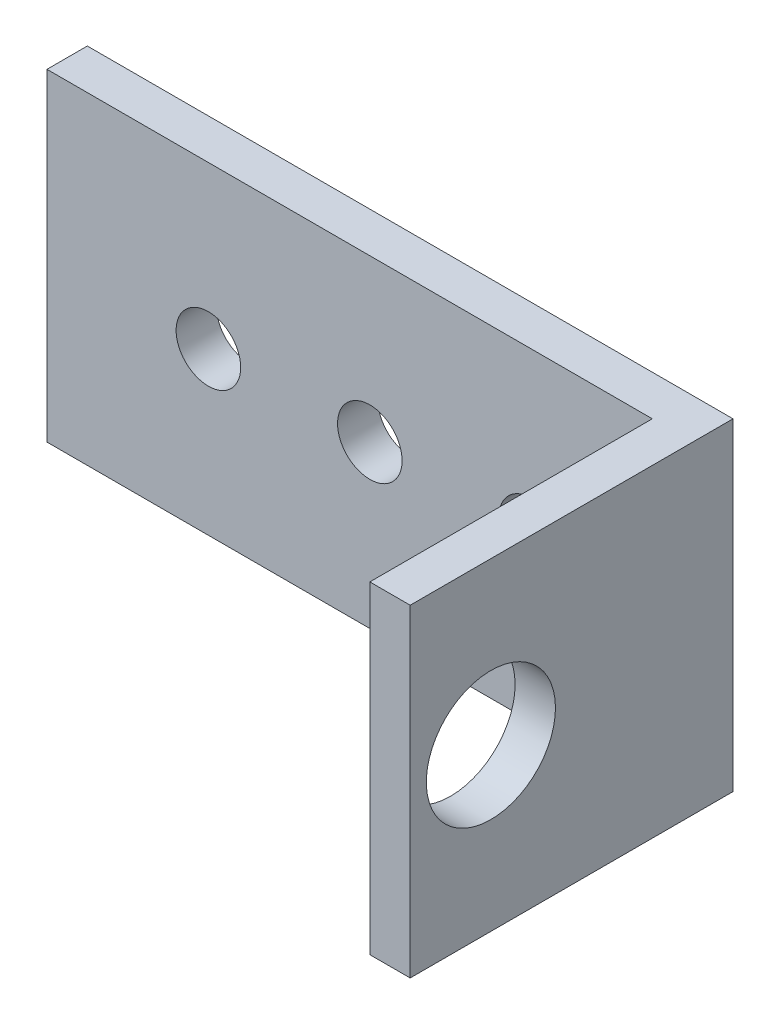
ISO-10303-21;
HEADER;
FILE_DESCRIPTION(('STEP AP214'),'2;1');
FILE_NAME('part.step','',(''),(''),'','','');
FILE_SCHEMA(('AUTOMOTIVE_DESIGN { 1 0 10303 214 1 1 1 1 }'));
ENDSEC;
DATA;
#1=APPLICATION_CONTEXT('core data for automotive mechanical design processes');
#2=APPLICATION_PROTOCOL_DEFINITION('international standard','automotive_design',2000,#1);
#3=PRODUCT_CONTEXT('',#1,'mechanical');
#4=PRODUCT('Part','Part','',(#3));
#5=PRODUCT_RELATED_PRODUCT_CATEGORY('part','',(#4));
#6=PRODUCT_DEFINITION_FORMATION('','',#4);
#7=PRODUCT_DEFINITION_CONTEXT('part definition',#1,'design');
#8=PRODUCT_DEFINITION('design','',#6,#7);
#9=PRODUCT_DEFINITION_SHAPE('','',#8);
#10=(LENGTH_UNIT() NAMED_UNIT(*) SI_UNIT(.MILLI.,.METRE.));
#11=(NAMED_UNIT(*) PLANE_ANGLE_UNIT() SI_UNIT($,.RADIAN.));
#12=(NAMED_UNIT(*) SI_UNIT($,.STERADIAN.) SOLID_ANGLE_UNIT());
#13=UNCERTAINTY_MEASURE_WITH_UNIT(LENGTH_MEASURE(1.E-05),#10,'distance_accuracy_value','');
#14=(GEOMETRIC_REPRESENTATION_CONTEXT(3) GLOBAL_UNCERTAINTY_ASSIGNED_CONTEXT((#13)) GLOBAL_UNIT_ASSIGNED_CONTEXT((#10,
#11,#12)) REPRESENTATION_CONTEXT('',''));
#15=CARTESIAN_POINT('',(0.,0.,0.));
#16=DIRECTION('',(0.,0.,1.));
#17=DIRECTION('',(1.,0.,0.));
#18=AXIS2_PLACEMENT_3D('',#15,#16,#17);
#19=CARTESIAN_POINT('',(22.225,25.4,0.));
#20=DIRECTION('',(-1.,0.,0.));
#21=DIRECTION('',(0.,0.,1.));
#22=AXIS2_PLACEMENT_3D('',#19,#20,#21);
#23=PLANE('',#22);
#24=CARTESIAN_POINT('',(22.225,12.7,6.35));
#25=DIRECTION('',(-1.,0.,0.));
#26=DIRECTION('',(0.,0.,1.));
#27=AXIS2_PLACEMENT_3D('',#24,#25,#26);
#28=CIRCLE('',#27,5.08);
#29=CARTESIAN_POINT('',(22.225,12.7,11.43));
#30=VERTEX_POINT('',#29);
#31=EDGE_CURVE('E122',#30,#30,#28,.F.);
#32=ORIENTED_EDGE('',*,*,#31,.T.);
#33=EDGE_LOOP('',(#32));
#34=FACE_BOUND('',#33,.T.);
#35=DIRECTION('',(0.,0.,-1.));
#36=VECTOR('',#35,1.);
#37=CARTESIAN_POINT('',(22.225,0.,0.));
#38=LINE('',#37,#36);
#39=CARTESIAN_POINT('',(22.225,0.,12.7));
#40=VERTEX_POINT('',#39);
#41=CARTESIAN_POINT('',(22.225,0.,-9.525));
#42=VERTEX_POINT('',#41);
#43=EDGE_CURVE('E118',#40,#42,#38,.T.);
#44=ORIENTED_EDGE('',*,*,#43,.F.);
#45=DIRECTION('',(0.,-1.,0.));
#46=VECTOR('',#45,1.);
#47=CARTESIAN_POINT('',(22.225,25.4,12.7));
#48=LINE('',#47,#46);
#49=CARTESIAN_POINT('',(22.225,25.4,12.7));
#50=VERTEX_POINT('',#49);
#51=EDGE_CURVE('E11',#50,#40,#48,.T.);
#52=ORIENTED_EDGE('',*,*,#51,.F.);
#53=DIRECTION('',(0.,0.,-1.));
#54=VECTOR('',#53,1.);
#55=CARTESIAN_POINT('',(22.225,25.4,0.));
#56=LINE('',#55,#54);
#57=CARTESIAN_POINT('',(22.225,25.4,-9.525));
#58=VERTEX_POINT('',#57);
#59=EDGE_CURVE('E132',#50,#58,#56,.T.);
#60=ORIENTED_EDGE('',*,*,#59,.T.);
#61=DIRECTION('',(0.,-1.,0.));
#62=VECTOR('',#61,1.);
#63=CARTESIAN_POINT('',(22.225,25.4,-9.525));
#64=LINE('',#63,#62);
#65=EDGE_CURVE('E81',#58,#42,#64,.T.);
#66=ORIENTED_EDGE('',*,*,#65,.T.);
#67=EDGE_LOOP('',(#44,#52,#60,#66));
#68=FACE_BOUND('',#67,.T.);
#69=ADVANCED_FACE('F37',(#34,#68),#23,.T.);
#70=CARTESIAN_POINT('',(0.,25.4,12.7));
#71=DIRECTION('',(0.,0.,-1.));
#72=DIRECTION('',(-1.,0.,0.));
#73=AXIS2_PLACEMENT_3D('',#70,#71,#72);
#74=PLANE('',#73);
#75=DIRECTION('',(1.,0.,0.));
#76=VECTOR('',#75,1.);
#77=CARTESIAN_POINT('',(0.,0.,12.7));
#78=LINE('',#77,#76);
#79=CARTESIAN_POINT('',(25.4,0.,12.7));
#80=VERTEX_POINT('',#79);
#81=EDGE_CURVE('E121',#40,#80,#78,.T.);
#82=ORIENTED_EDGE('',*,*,#81,.T.);
#83=DIRECTION('',(0.,-1.,0.));
#84=VECTOR('',#83,1.);
#85=CARTESIAN_POINT('',(25.4,25.4,12.7));
#86=LINE('',#85,#84);
#87=CARTESIAN_POINT('',(25.4,25.4,12.7));
#88=VERTEX_POINT('',#87);
#89=EDGE_CURVE('E45',#88,#80,#86,.T.);
#90=ORIENTED_EDGE('',*,*,#89,.F.);
#91=DIRECTION('',(1.,0.,0.));
#92=VECTOR('',#91,1.);
#93=CARTESIAN_POINT('',(0.,25.4,12.7));
#94=LINE('',#93,#92);
#95=EDGE_CURVE('E145',#50,#88,#94,.T.);
#96=ORIENTED_EDGE('',*,*,#95,.F.);
#97=ORIENTED_EDGE('',*,*,#51,.T.);
#98=EDGE_LOOP('',(#82,#90,#96,#97));
#99=FACE_BOUND('',#98,.T.);
#100=ADVANCED_FACE('F199',(#99),#74,.F.);
#101=CARTESIAN_POINT('',(25.4,25.4,0.));
#102=DIRECTION('',(-1.,0.,0.));
#103=DIRECTION('',(0.,0.,1.));
#104=AXIS2_PLACEMENT_3D('',#101,#102,#103);
#105=PLANE('',#104);
#106=CARTESIAN_POINT('',(25.4,12.7,6.35));
#107=DIRECTION('',(1.,0.,0.));
#108=DIRECTION('',(0.,0.,-1.));
#109=AXIS2_PLACEMENT_3D('',#106,#107,#108);
#110=CIRCLE('',#109,5.08);
#111=CARTESIAN_POINT('',(25.4,12.7,1.27));
#112=VERTEX_POINT('',#111);
#113=EDGE_CURVE('E151',#112,#112,#110,.T.);
#114=ORIENTED_EDGE('',*,*,#113,.F.);
#115=EDGE_LOOP('',(#114));
#116=FACE_BOUND('',#115,.T.);
#117=DIRECTION('',(0.,0.,-1.));
#118=VECTOR('',#117,1.);
#119=CARTESIAN_POINT('',(25.4,0.,0.));
#120=LINE('',#119,#118);
#121=CARTESIAN_POINT('',(25.4,0.,-12.7));
#122=VERTEX_POINT('',#121);
#123=EDGE_CURVE('E124',#80,#122,#120,.T.);
#124=ORIENTED_EDGE('',*,*,#123,.T.);
#125=DIRECTION('',(0.,-1.,0.));
#126=VECTOR('',#125,1.);
#127=CARTESIAN_POINT('',(25.4,25.4,-12.7));
#128=LINE('',#127,#126);
#129=CARTESIAN_POINT('',(25.4,25.4,-12.7));
#130=VERTEX_POINT('',#129);
#131=EDGE_CURVE('E105',#130,#122,#128,.T.);
#132=ORIENTED_EDGE('',*,*,#131,.F.);
#133=DIRECTION('',(0.,0.,-1.));
#134=VECTOR('',#133,1.);
#135=CARTESIAN_POINT('',(25.4,25.4,0.));
#136=LINE('',#135,#134);
#137=EDGE_CURVE('E110',#88,#130,#136,.T.);
#138=ORIENTED_EDGE('',*,*,#137,.F.);
#139=ORIENTED_EDGE('',*,*,#89,.T.);
#140=EDGE_LOOP('',(#124,#132,#138,#139));
#141=FACE_BOUND('',#140,.T.);
#142=ADVANCED_FACE('F139',(#116,#141),#105,.F.);
#143=CARTESIAN_POINT('',(0.,25.4,-12.7));
#144=DIRECTION('',(0.,0.,-1.));
#145=DIRECTION('',(-1.,0.,0.));
#146=AXIS2_PLACEMENT_3D('',#143,#144,#145);
#147=PLANE('',#146);
#148=CARTESIAN_POINT('',(-12.7,12.7,-12.7));
#149=DIRECTION('',(0.,0.,-1.));
#150=DIRECTION('',(-1.,0.,0.));
#151=AXIS2_PLACEMENT_3D('',#148,#149,#150);
#152=CIRCLE('',#151,2.54);
#153=CARTESIAN_POINT('',(-15.24,12.7,-12.7));
#154=VERTEX_POINT('',#153);
#155=EDGE_CURVE('E154',#154,#154,#152,.F.);
#156=ORIENTED_EDGE('',*,*,#155,.T.);
#157=EDGE_LOOP('',(#156));
#158=FACE_BOUND('',#157,.T.);
#159=CARTESIAN_POINT('',(0.,12.7,-12.7));
#160=DIRECTION('',(0.,0.,-1.));
#161=DIRECTION('',(-1.,0.,0.));
#162=AXIS2_PLACEMENT_3D('',#159,#160,#161);
#163=CIRCLE('',#162,2.54);
#164=CARTESIAN_POINT('',(-2.53999999999999,12.7,-12.7));
#165=VERTEX_POINT('',#164);
#166=EDGE_CURVE('E162',#165,#165,#163,.F.);
#167=ORIENTED_EDGE('',*,*,#166,.T.);
#168=EDGE_LOOP('',(#167));
#169=FACE_BOUND('',#168,.T.);
#170=CARTESIAN_POINT('',(12.7,12.7,-12.7));
#171=DIRECTION('',(0.,0.,-1.));
#172=DIRECTION('',(-1.,0.,0.));
#173=AXIS2_PLACEMENT_3D('',#170,#171,#172);
#174=CIRCLE('',#173,2.54);
#175=CARTESIAN_POINT('',(10.16,12.7,-12.7));
#176=VERTEX_POINT('',#175);
#177=EDGE_CURVE('E155',#176,#176,#174,.F.);
#178=ORIENTED_EDGE('',*,*,#177,.T.);
#179=EDGE_LOOP('',(#178));
#180=FACE_BOUND('',#179,.T.);
#181=DIRECTION('',(1.,0.,0.));
#182=VECTOR('',#181,1.);
#183=CARTESIAN_POINT('',(0.,0.,-12.7));
#184=LINE('',#183,#182);
#185=CARTESIAN_POINT('',(-25.4,0.,-12.7));
#186=VERTEX_POINT('',#185);
#187=EDGE_CURVE('E100',#186,#122,#184,.T.);
#188=ORIENTED_EDGE('',*,*,#187,.F.);
#189=DIRECTION('',(0.,-1.,0.));
#190=VECTOR('',#189,1.);
#191=CARTESIAN_POINT('',(-25.4,25.4,-12.7));
#192=LINE('',#191,#190);
#193=CARTESIAN_POINT('',(-25.4,25.4,-12.7));
#194=VERTEX_POINT('',#193);
#195=EDGE_CURVE('E95',#194,#186,#192,.T.);
#196=ORIENTED_EDGE('',*,*,#195,.F.);
#197=DIRECTION('',(1.,0.,0.));
#198=VECTOR('',#197,1.);
#199=CARTESIAN_POINT('',(0.,25.4,-12.7));
#200=LINE('',#199,#198);
#201=EDGE_CURVE('E98',#194,#130,#200,.T.);
#202=ORIENTED_EDGE('',*,*,#201,.T.);
#203=ORIENTED_EDGE('',*,*,#131,.T.);
#204=EDGE_LOOP('',(#188,#196,#202,#203));
#205=FACE_BOUND('',#204,.T.);
#206=ADVANCED_FACE('F97',(#158,#169,#180,#205),#147,.T.);
#207=CARTESIAN_POINT('',(-25.4,25.4,0.));
#208=DIRECTION('',(-1.,0.,0.));
#209=DIRECTION('',(0.,0.,1.));
#210=AXIS2_PLACEMENT_3D('',#207,#208,#209);
#211=PLANE('',#210);
#212=DIRECTION('',(0.,0.,-1.));
#213=VECTOR('',#212,1.);
#214=CARTESIAN_POINT('',(-25.4,0.,0.));
#215=LINE('',#214,#213);
#216=CARTESIAN_POINT('',(-25.4,0.,-9.525));
#217=VERTEX_POINT('',#216);
#218=EDGE_CURVE('E128',#217,#186,#215,.T.);
#219=ORIENTED_EDGE('',*,*,#218,.F.);
#220=DIRECTION('',(0.,-1.,0.));
#221=VECTOR('',#220,1.);
#222=CARTESIAN_POINT('',(-25.4,25.4,-9.525));
#223=LINE('',#222,#221);
#224=CARTESIAN_POINT('',(-25.4,25.4,-9.525));
#225=VERTEX_POINT('',#224);
#226=EDGE_CURVE('E74',#225,#217,#223,.T.);
#227=ORIENTED_EDGE('',*,*,#226,.F.);
#228=DIRECTION('',(0.,0.,-1.));
#229=VECTOR('',#228,1.);
#230=CARTESIAN_POINT('',(-25.4,25.4,0.));
#231=LINE('',#230,#229);
#232=EDGE_CURVE('E108',#225,#194,#231,.T.);
#233=ORIENTED_EDGE('',*,*,#232,.T.);
#234=ORIENTED_EDGE('',*,*,#195,.T.);
#235=EDGE_LOOP('',(#219,#227,#233,#234));
#236=FACE_BOUND('',#235,.T.);
#237=ADVANCED_FACE('F113',(#236),#211,.T.);
#238=CARTESIAN_POINT('',(0.,25.4,-9.525));
#239=DIRECTION('',(0.,0.,-1.));
#240=DIRECTION('',(-1.,0.,0.));
#241=AXIS2_PLACEMENT_3D('',#238,#239,#240);
#242=PLANE('',#241);
#243=CARTESIAN_POINT('',(-12.7,12.7,-9.525));
#244=DIRECTION('',(0.,0.,1.));
#245=DIRECTION('',(1.,0.,0.));
#246=AXIS2_PLACEMENT_3D('',#243,#244,#245);
#247=CIRCLE('',#246,2.54);
#248=CARTESIAN_POINT('',(-10.16,12.7,-9.525));
#249=VERTEX_POINT('',#248);
#250=EDGE_CURVE('E165',#249,#249,#247,.T.);
#251=ORIENTED_EDGE('',*,*,#250,.F.);
#252=EDGE_LOOP('',(#251));
#253=FACE_BOUND('',#252,.T.);
#254=CARTESIAN_POINT('',(0.,12.7,-9.525));
#255=DIRECTION('',(0.,0.,1.));
#256=DIRECTION('',(1.,0.,0.));
#257=AXIS2_PLACEMENT_3D('',#254,#255,#256);
#258=CIRCLE('',#257,2.54);
#259=CARTESIAN_POINT('',(2.54000000000001,12.7,-9.525));
#260=VERTEX_POINT('',#259);
#261=EDGE_CURVE('E158',#260,#260,#258,.T.);
#262=ORIENTED_EDGE('',*,*,#261,.F.);
#263=EDGE_LOOP('',(#262));
#264=FACE_BOUND('',#263,.T.);
#265=CARTESIAN_POINT('',(12.7,12.7,-9.525));
#266=DIRECTION('',(0.,0.,1.));
#267=DIRECTION('',(1.,0.,0.));
#268=AXIS2_PLACEMENT_3D('',#265,#266,#267);
#269=CIRCLE('',#268,2.54);
#270=CARTESIAN_POINT('',(15.24,12.7,-9.525));
#271=VERTEX_POINT('',#270);
#272=EDGE_CURVE('E159',#271,#271,#269,.T.);
#273=ORIENTED_EDGE('',*,*,#272,.F.);
#274=EDGE_LOOP('',(#273));
#275=FACE_BOUND('',#274,.T.);
#276=DIRECTION('',(1.,0.,0.));
#277=VECTOR('',#276,1.);
#278=CARTESIAN_POINT('',(0.,0.,-9.525));
#279=LINE('',#278,#277);
#280=EDGE_CURVE('E130',#217,#42,#279,.T.);
#281=ORIENTED_EDGE('',*,*,#280,.T.);
#282=ORIENTED_EDGE('',*,*,#65,.F.);
#283=DIRECTION('',(1.,0.,0.));
#284=VECTOR('',#283,1.);
#285=CARTESIAN_POINT('',(0.,25.4,-9.525));
#286=LINE('',#285,#284);
#287=EDGE_CURVE('E53',#225,#58,#286,.T.);
#288=ORIENTED_EDGE('',*,*,#287,.F.);
#289=ORIENTED_EDGE('',*,*,#226,.T.);
#290=EDGE_LOOP('',(#281,#282,#288,#289));
#291=FACE_BOUND('',#290,.T.);
#292=ADVANCED_FACE('F144',(#253,#264,#275,#291),#242,.F.);
#293=CARTESIAN_POINT('',(0.,25.4,0.));
#294=DIRECTION('',(0.,1.,0.));
#295=DIRECTION('',(0.,0.,1.));
#296=AXIS2_PLACEMENT_3D('',#293,#294,#295);
#297=PLANE('',#296);
#298=ORIENTED_EDGE('',*,*,#59,.F.);
#299=ORIENTED_EDGE('',*,*,#95,.T.);
#300=ORIENTED_EDGE('',*,*,#137,.T.);
#301=ORIENTED_EDGE('',*,*,#201,.F.);
#302=ORIENTED_EDGE('',*,*,#232,.F.);
#303=ORIENTED_EDGE('',*,*,#287,.T.);
#304=EDGE_LOOP('',(#298,#299,#300,#301,#302,#303));
#305=FACE_BOUND('',#304,.T.);
#306=ADVANCED_FACE('F107',(#305),#297,.T.);
#307=CARTESIAN_POINT('',(0.,0.,0.));
#308=DIRECTION('',(0.,1.,0.));
#309=DIRECTION('',(0.,0.,1.));
#310=AXIS2_PLACEMENT_3D('',#307,#308,#309);
#311=PLANE('',#310);
#312=ORIENTED_EDGE('',*,*,#43,.T.);
#313=ORIENTED_EDGE('',*,*,#280,.F.);
#314=ORIENTED_EDGE('',*,*,#218,.T.);
#315=ORIENTED_EDGE('',*,*,#187,.T.);
#316=ORIENTED_EDGE('',*,*,#123,.F.);
#317=ORIENTED_EDGE('',*,*,#81,.F.);
#318=EDGE_LOOP('',(#312,#313,#314,#315,#316,#317));
#319=FACE_BOUND('',#318,.T.);
#320=ADVANCED_FACE('F143',(#319),#311,.F.);
#321=CARTESIAN_POINT('',(7.85659020628935,12.7,6.35));
#322=DIRECTION('',(1.,0.,0.));
#323=DIRECTION('',(0.,0.,-1.));
#324=AXIS2_PLACEMENT_3D('',#321,#322,#323);
#325=CYLINDRICAL_SURFACE('',#324,5.08);
#326=ORIENTED_EDGE('',*,*,#113,.T.);
#327=EDGE_LOOP('',(#326));
#328=FACE_BOUND('',#327,.T.);
#329=ORIENTED_EDGE('',*,*,#31,.F.);
#330=EDGE_LOOP('',(#329));
#331=FACE_BOUND('',#330,.T.);
#332=ADVANCED_FACE('F187',(#328,#331),#325,.F.);
#333=CARTESIAN_POINT('',(12.7,12.7,-19.8842048968553));
#334=DIRECTION('',(0.,0.,1.));
#335=DIRECTION('',(1.,0.,0.));
#336=AXIS2_PLACEMENT_3D('',#333,#334,#335);
#337=CYLINDRICAL_SURFACE('',#336,2.54);
#338=ORIENTED_EDGE('',*,*,#272,.T.);
#339=EDGE_LOOP('',(#338));
#340=FACE_BOUND('',#339,.T.);
#341=ORIENTED_EDGE('',*,*,#177,.F.);
#342=EDGE_LOOP('',(#341));
#343=FACE_BOUND('',#342,.T.);
#344=ADVANCED_FACE('F183',(#340,#343),#337,.F.);
#345=CARTESIAN_POINT('',(0.,12.7,-19.8842048968553));
#346=DIRECTION('',(0.,0.,1.));
#347=DIRECTION('',(1.,0.,0.));
#348=AXIS2_PLACEMENT_3D('',#345,#346,#347);
#349=CYLINDRICAL_SURFACE('',#348,2.54);
#350=ORIENTED_EDGE('',*,*,#261,.T.);
#351=EDGE_LOOP('',(#350));
#352=FACE_BOUND('',#351,.T.);
#353=ORIENTED_EDGE('',*,*,#166,.F.);
#354=EDGE_LOOP('',(#353));
#355=FACE_BOUND('',#354,.T.);
#356=ADVANCED_FACE('F186',(#352,#355),#349,.F.);
#357=CARTESIAN_POINT('',(-12.7,12.7,-19.8842048968553));
#358=DIRECTION('',(0.,0.,1.));
#359=DIRECTION('',(1.,0.,0.));
#360=AXIS2_PLACEMENT_3D('',#357,#358,#359);
#361=CYLINDRICAL_SURFACE('',#360,2.54);
#362=ORIENTED_EDGE('',*,*,#250,.T.);
#363=EDGE_LOOP('',(#362));
#364=FACE_BOUND('',#363,.T.);
#365=ORIENTED_EDGE('',*,*,#155,.F.);
#366=EDGE_LOOP('',(#365));
#367=FACE_BOUND('',#366,.T.);
#368=ADVANCED_FACE('F173',(#364,#367),#361,.F.);
#369=CLOSED_SHELL('',(#69,#100,#142,#206,#237,#292,#306,#320,#332,#344,#356,#368));
#370=MANIFOLD_SOLID_BREP('B2',#369);
#371=ADVANCED_BREP_SHAPE_REPRESENTATION('',(#18,#370),#14);
#372=SHAPE_DEFINITION_REPRESENTATION(#9,#371);
ENDSEC;
END-ISO-10303-21;
